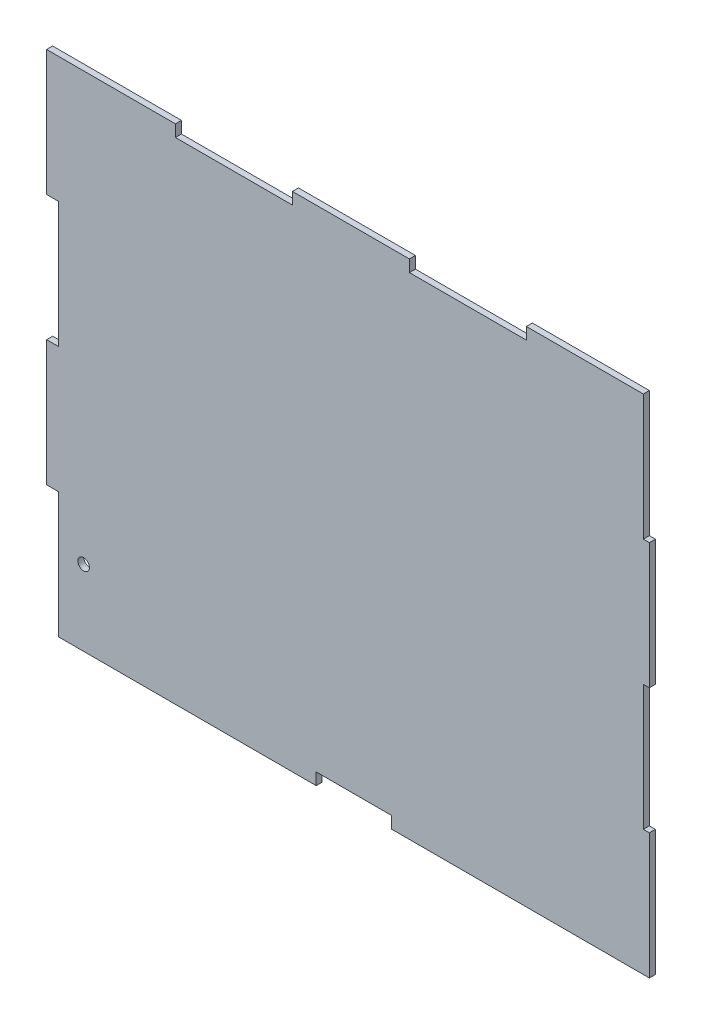
ISO-10303-21;
HEADER;
FILE_DESCRIPTION(('STEP AP214'),'2;1');
FILE_NAME('part.step','',(''),(''),'','','');
FILE_SCHEMA(('AUTOMOTIVE_DESIGN { 1 0 10303 214 1 1 1 1 }'));
ENDSEC;
DATA;
#1=APPLICATION_CONTEXT('core data for automotive mechanical design processes');
#2=APPLICATION_PROTOCOL_DEFINITION('international standard','automotive_design',2000,#1);
#3=PRODUCT_CONTEXT('',#1,'mechanical');
#4=PRODUCT('Part','Part','',(#3));
#5=PRODUCT_RELATED_PRODUCT_CATEGORY('part','',(#4));
#6=PRODUCT_DEFINITION_FORMATION('','',#4);
#7=PRODUCT_DEFINITION_CONTEXT('part definition',#1,'design');
#8=PRODUCT_DEFINITION('design','',#6,#7);
#9=PRODUCT_DEFINITION_SHAPE('','',#8);
#10=(LENGTH_UNIT() NAMED_UNIT(*) SI_UNIT(.MILLI.,.METRE.));
#11=(NAMED_UNIT(*) PLANE_ANGLE_UNIT() SI_UNIT($,.RADIAN.));
#12=(NAMED_UNIT(*) SI_UNIT($,.STERADIAN.) SOLID_ANGLE_UNIT());
#13=UNCERTAINTY_MEASURE_WITH_UNIT(LENGTH_MEASURE(1.E-05),#10,'distance_accuracy_value','');
#14=(GEOMETRIC_REPRESENTATION_CONTEXT(3) GLOBAL_UNCERTAINTY_ASSIGNED_CONTEXT((#13)) GLOBAL_UNIT_ASSIGNED_CONTEXT((#10,
#11,#12)) REPRESENTATION_CONTEXT('',''));
#15=CARTESIAN_POINT('',(0.,0.,0.));
#16=DIRECTION('',(0.,0.,1.));
#17=DIRECTION('',(1.,0.,0.));
#18=AXIS2_PLACEMENT_3D('',#15,#16,#17);
#19=CARTESIAN_POINT('',(59.0804,253.929256228265,3.048));
#20=DIRECTION('',(-1.,0.,0.));
#21=DIRECTION('',(0.,-1.,0.));
#22=AXIS2_PLACEMENT_3D('',#19,#20,#21);
#23=PLANE('',#22);
#24=DIRECTION('',(0.,1.,0.));
#25=VECTOR('',#24,1.);
#26=CARTESIAN_POINT('',(59.0804,253.929256228265,0.));
#27=LINE('',#26,#25);
#28=CARTESIAN_POINT('',(59.0804,247.960256228265,0.));
#29=VERTEX_POINT('',#28);
#30=CARTESIAN_POINT('',(59.0804,253.929256228265,0.));
#31=VERTEX_POINT('',#30);
#32=EDGE_CURVE('E248',#29,#31,#27,.T.);
#33=ORIENTED_EDGE('',*,*,#32,.T.);
#34=DIRECTION('',(0.,0.,-1.));
#35=VECTOR('',#34,1.);
#36=CARTESIAN_POINT('',(59.0804,253.929256228265,3.048));
#37=LINE('',#36,#35);
#38=CARTESIAN_POINT('',(59.0804,253.929256228265,3.048));
#39=VERTEX_POINT('',#38);
#40=EDGE_CURVE('E11',#39,#31,#37,.T.);
#41=ORIENTED_EDGE('',*,*,#40,.F.);
#42=DIRECTION('',(0.,1.,0.));
#43=VECTOR('',#42,1.);
#44=CARTESIAN_POINT('',(59.0804,253.929256228265,3.048));
#45=LINE('',#44,#43);
#46=CARTESIAN_POINT('',(59.0804,247.960256228265,3.048));
#47=VERTEX_POINT('',#46);
#48=EDGE_CURVE('E303',#47,#39,#45,.T.);
#49=ORIENTED_EDGE('',*,*,#48,.F.);
#50=DIRECTION('',(0.,0.,-1.));
#51=VECTOR('',#50,1.);
#52=CARTESIAN_POINT('',(59.0804,247.960256228265,3.048));
#53=LINE('',#52,#51);
#54=EDGE_CURVE('E244',#47,#29,#53,.T.);
#55=ORIENTED_EDGE('',*,*,#54,.T.);
#56=EDGE_LOOP('',(#33,#41,#49,#55));
#57=FACE_BOUND('',#56,.T.);
#58=ADVANCED_FACE('F32',(#57),#23,.F.);
#59=CARTESIAN_POINT('',(-5.9944,253.929256228265,3.048));
#60=DIRECTION('',(0.,-1.,0.));
#61=DIRECTION('',(0.,0.,-1.));
#62=AXIS2_PLACEMENT_3D('',#59,#60,#61);
#63=PLANE('',#62);
#64=DIRECTION('',(-1.,0.,0.));
#65=VECTOR('',#64,1.);
#66=CARTESIAN_POINT('',(-5.9944,253.929256228265,0.));
#67=LINE('',#66,#65);
#68=CARTESIAN_POINT('',(-5.9944,253.929256228265,0.));
#69=VERTEX_POINT('',#68);
#70=EDGE_CURVE('E251',#31,#69,#67,.T.);
#71=ORIENTED_EDGE('',*,*,#70,.T.);
#72=DIRECTION('',(0.,0.,-1.));
#73=VECTOR('',#72,1.);
#74=CARTESIAN_POINT('',(-5.9944,253.929256228265,3.048));
#75=LINE('',#74,#73);
#76=CARTESIAN_POINT('',(-5.9944,253.929256228265,3.048));
#77=VERTEX_POINT('',#76);
#78=EDGE_CURVE('E40',#77,#69,#75,.T.);
#79=ORIENTED_EDGE('',*,*,#78,.F.);
#80=DIRECTION('',(-1.,0.,0.));
#81=VECTOR('',#80,1.);
#82=CARTESIAN_POINT('',(-5.9944,253.929256228265,3.048));
#83=LINE('',#82,#81);
#84=EDGE_CURVE('E151',#39,#77,#83,.T.);
#85=ORIENTED_EDGE('',*,*,#84,.F.);
#86=ORIENTED_EDGE('',*,*,#40,.T.);
#87=EDGE_LOOP('',(#71,#79,#85,#86));
#88=FACE_BOUND('',#87,.T.);
#89=ADVANCED_FACE('F462',(#88),#63,.F.);
#90=CARTESIAN_POINT('',(-5.9944,190.5,3.048));
#91=DIRECTION('',(1.,0.,0.));
#92=DIRECTION('',(0.,1.,0.));
#93=AXIS2_PLACEMENT_3D('',#90,#91,#92);
#94=PLANE('',#93);
#95=DIRECTION('',(0.,-1.,0.));
#96=VECTOR('',#95,1.);
#97=CARTESIAN_POINT('',(-5.9944,190.5,0.));
#98=LINE('',#97,#96);
#99=CARTESIAN_POINT('',(-5.9944,190.5,0.));
#100=VERTEX_POINT('',#99);
#101=EDGE_CURVE('E254',#69,#100,#98,.T.);
#102=ORIENTED_EDGE('',*,*,#101,.T.);
#103=DIRECTION('',(0.,0.,-1.));
#104=VECTOR('',#103,1.);
#105=CARTESIAN_POINT('',(-5.9944,190.5,3.048));
#106=LINE('',#105,#104);
#107=CARTESIAN_POINT('',(-5.9944,190.5,3.048));
#108=VERTEX_POINT('',#107);
#109=EDGE_CURVE('E370',#108,#100,#106,.T.);
#110=ORIENTED_EDGE('',*,*,#109,.F.);
#111=DIRECTION('',(0.,-1.,0.));
#112=VECTOR('',#111,1.);
#113=CARTESIAN_POINT('',(-5.9944,190.5,3.048));
#114=LINE('',#113,#112);
#115=EDGE_CURVE('E378',#77,#108,#114,.T.);
#116=ORIENTED_EDGE('',*,*,#115,.F.);
#117=ORIENTED_EDGE('',*,*,#78,.T.);
#118=EDGE_LOOP('',(#102,#110,#116,#117));
#119=FACE_BOUND('',#118,.T.);
#120=ADVANCED_FACE('F376',(#119),#94,.F.);
#121=CARTESIAN_POINT('',(0.,190.5,3.048));
#122=DIRECTION('',(0.,1.,0.));
#123=DIRECTION('',(0.,0.,1.));
#124=AXIS2_PLACEMENT_3D('',#121,#122,#123);
#125=PLANE('',#124);
#126=DIRECTION('',(1.,0.,0.));
#127=VECTOR('',#126,1.);
#128=CARTESIAN_POINT('',(0.,190.5,0.));
#129=LINE('',#128,#127);
#130=CARTESIAN_POINT('',(0.,190.5,0.));
#131=VERTEX_POINT('',#130);
#132=EDGE_CURVE('E256',#100,#131,#129,.T.);
#133=ORIENTED_EDGE('',*,*,#132,.T.);
#134=DIRECTION('',(0.,0.,-1.));
#135=VECTOR('',#134,1.);
#136=CARTESIAN_POINT('',(0.,190.5,3.048));
#137=LINE('',#136,#135);
#138=CARTESIAN_POINT('',(0.,190.5,3.048));
#139=VERTEX_POINT('',#138);
#140=EDGE_CURVE('E367',#139,#131,#137,.T.);
#141=ORIENTED_EDGE('',*,*,#140,.F.);
#142=DIRECTION('',(1.,0.,0.));
#143=VECTOR('',#142,1.);
#144=CARTESIAN_POINT('',(0.,190.5,3.048));
#145=LINE('',#144,#143);
#146=EDGE_CURVE('E396',#108,#139,#145,.T.);
#147=ORIENTED_EDGE('',*,*,#146,.F.);
#148=ORIENTED_EDGE('',*,*,#109,.T.);
#149=EDGE_LOOP('',(#133,#141,#147,#148));
#150=FACE_BOUND('',#149,.T.);
#151=ADVANCED_FACE('F387',(#150),#125,.F.);
#152=CARTESIAN_POINT('',(0.,127.,3.048));
#153=DIRECTION('',(1.,0.,0.));
#154=DIRECTION('',(0.,0.,-1.));
#155=AXIS2_PLACEMENT_3D('',#152,#153,#154);
#156=PLANE('',#155);
#157=DIRECTION('',(0.,-1.,0.));
#158=VECTOR('',#157,1.);
#159=CARTESIAN_POINT('',(0.,127.,0.));
#160=LINE('',#159,#158);
#161=CARTESIAN_POINT('',(0.,127.,0.));
#162=VERTEX_POINT('',#161);
#163=EDGE_CURVE('E258',#131,#162,#160,.T.);
#164=ORIENTED_EDGE('',*,*,#163,.T.);
#165=DIRECTION('',(0.,0.,-1.));
#166=VECTOR('',#165,1.);
#167=CARTESIAN_POINT('',(0.,127.,3.048));
#168=LINE('',#167,#166);
#169=CARTESIAN_POINT('',(0.,127.,3.048));
#170=VERTEX_POINT('',#169);
#171=EDGE_CURVE('E364',#170,#162,#168,.T.);
#172=ORIENTED_EDGE('',*,*,#171,.F.);
#173=DIRECTION('',(0.,-1.,0.));
#174=VECTOR('',#173,1.);
#175=CARTESIAN_POINT('',(0.,127.,3.048));
#176=LINE('',#175,#174);
#177=EDGE_CURVE('E393',#139,#170,#176,.T.);
#178=ORIENTED_EDGE('',*,*,#177,.F.);
#179=ORIENTED_EDGE('',*,*,#140,.T.);
#180=EDGE_LOOP('',(#164,#172,#178,#179));
#181=FACE_BOUND('',#180,.T.);
#182=ADVANCED_FACE('F391',(#181),#156,.F.);
#183=CARTESIAN_POINT('',(0.,127.,3.048));
#184=DIRECTION('',(0.,-1.,0.));
#185=DIRECTION('',(0.,0.,-1.));
#186=AXIS2_PLACEMENT_3D('',#183,#184,#185);
#187=PLANE('',#186);
#188=DIRECTION('',(-1.,0.,0.));
#189=VECTOR('',#188,1.);
#190=CARTESIAN_POINT('',(0.,127.,0.));
#191=LINE('',#190,#189);
#192=CARTESIAN_POINT('',(-5.9944,127.,0.));
#193=VERTEX_POINT('',#192);
#194=EDGE_CURVE('E260',#162,#193,#191,.T.);
#195=ORIENTED_EDGE('',*,*,#194,.T.);
#196=DIRECTION('',(0.,0.,-1.));
#197=VECTOR('',#196,1.);
#198=CARTESIAN_POINT('',(-5.9944,127.,3.048));
#199=LINE('',#198,#197);
#200=CARTESIAN_POINT('',(-5.9944,127.,3.048));
#201=VERTEX_POINT('',#200);
#202=EDGE_CURVE('E361',#201,#193,#199,.T.);
#203=ORIENTED_EDGE('',*,*,#202,.F.);
#204=DIRECTION('',(-1.,0.,0.));
#205=VECTOR('',#204,1.);
#206=CARTESIAN_POINT('',(0.,127.,3.048));
#207=LINE('',#206,#205);
#208=EDGE_CURVE('E395',#170,#201,#207,.T.);
#209=ORIENTED_EDGE('',*,*,#208,.F.);
#210=ORIENTED_EDGE('',*,*,#171,.T.);
#211=EDGE_LOOP('',(#195,#203,#209,#210));
#212=FACE_BOUND('',#211,.T.);
#213=ADVANCED_FACE('F475',(#212),#187,.F.);
#214=CARTESIAN_POINT('',(-5.9944,63.5,3.048));
#215=DIRECTION('',(1.,0.,0.));
#216=DIRECTION('',(0.,0.,-1.));
#217=AXIS2_PLACEMENT_3D('',#214,#215,#216);
#218=PLANE('',#217);
#219=DIRECTION('',(0.,-1.,0.));
#220=VECTOR('',#219,1.);
#221=CARTESIAN_POINT('',(-5.9944,63.5,0.));
#222=LINE('',#221,#220);
#223=CARTESIAN_POINT('',(-5.9944,63.5,0.));
#224=VERTEX_POINT('',#223);
#225=EDGE_CURVE('E262',#193,#224,#222,.T.);
#226=ORIENTED_EDGE('',*,*,#225,.T.);
#227=DIRECTION('',(0.,0.,-1.));
#228=VECTOR('',#227,1.);
#229=CARTESIAN_POINT('',(-5.9944,63.5,3.048));
#230=LINE('',#229,#228);
#231=CARTESIAN_POINT('',(-5.9944,63.5,3.048));
#232=VERTEX_POINT('',#231);
#233=EDGE_CURVE('E358',#232,#224,#230,.T.);
#234=ORIENTED_EDGE('',*,*,#233,.F.);
#235=DIRECTION('',(0.,-1.,0.));
#236=VECTOR('',#235,1.);
#237=CARTESIAN_POINT('',(-5.9944,63.5,3.048));
#238=LINE('',#237,#236);
#239=EDGE_CURVE('E398',#201,#232,#238,.T.);
#240=ORIENTED_EDGE('',*,*,#239,.F.);
#241=ORIENTED_EDGE('',*,*,#202,.T.);
#242=EDGE_LOOP('',(#226,#234,#240,#241));
#243=FACE_BOUND('',#242,.T.);
#244=ADVANCED_FACE('F478',(#243),#218,.F.);
#245=CARTESIAN_POINT('',(0.,63.5,3.048));
#246=DIRECTION('',(0.,1.,0.));
#247=DIRECTION('',(0.,0.,1.));
#248=AXIS2_PLACEMENT_3D('',#245,#246,#247);
#249=PLANE('',#248);
#250=DIRECTION('',(1.,0.,0.));
#251=VECTOR('',#250,1.);
#252=CARTESIAN_POINT('',(0.,63.5,0.));
#253=LINE('',#252,#251);
#254=CARTESIAN_POINT('',(0.,63.5,0.));
#255=VERTEX_POINT('',#254);
#256=EDGE_CURVE('E264',#224,#255,#253,.T.);
#257=ORIENTED_EDGE('',*,*,#256,.T.);
#258=DIRECTION('',(0.,0.,-1.));
#259=VECTOR('',#258,1.);
#260=CARTESIAN_POINT('',(0.,63.5,3.048));
#261=LINE('',#260,#259);
#262=CARTESIAN_POINT('',(0.,63.5,3.048));
#263=VERTEX_POINT('',#262);
#264=EDGE_CURVE('E355',#263,#255,#261,.T.);
#265=ORIENTED_EDGE('',*,*,#264,.F.);
#266=DIRECTION('',(1.,0.,0.));
#267=VECTOR('',#266,1.);
#268=CARTESIAN_POINT('',(0.,63.5,3.048));
#269=LINE('',#268,#267);
#270=EDGE_CURVE('E404',#232,#263,#269,.T.);
#271=ORIENTED_EDGE('',*,*,#270,.F.);
#272=ORIENTED_EDGE('',*,*,#233,.T.);
#273=EDGE_LOOP('',(#257,#265,#271,#272));
#274=FACE_BOUND('',#273,.T.);
#275=ADVANCED_FACE('F482',(#274),#249,.F.);
#276=CARTESIAN_POINT('',(0.,0.,3.048));
#277=DIRECTION('',(1.,0.,0.));
#278=DIRECTION('',(0.,0.,-1.));
#279=AXIS2_PLACEMENT_3D('',#276,#277,#278);
#280=PLANE('',#279);
#281=DIRECTION('',(0.,-1.,0.));
#282=VECTOR('',#281,1.);
#283=CARTESIAN_POINT('',(0.,0.,0.));
#284=LINE('',#283,#282);
#285=CARTESIAN_POINT('',(0.,0.,0.));
#286=VERTEX_POINT('',#285);
#287=EDGE_CURVE('E266',#255,#286,#284,.T.);
#288=ORIENTED_EDGE('',*,*,#287,.T.);
#289=DIRECTION('',(0.,0.,-1.));
#290=VECTOR('',#289,1.);
#291=CARTESIAN_POINT('',(0.,0.,3.048));
#292=LINE('',#291,#290);
#293=CARTESIAN_POINT('',(0.,0.,3.048));
#294=VERTEX_POINT('',#293);
#295=EDGE_CURVE('E352',#294,#286,#292,.T.);
#296=ORIENTED_EDGE('',*,*,#295,.F.);
#297=DIRECTION('',(0.,-1.,0.));
#298=VECTOR('',#297,1.);
#299=CARTESIAN_POINT('',(0.,0.,3.048));
#300=LINE('',#299,#298);
#301=EDGE_CURVE('E406',#263,#294,#300,.T.);
#302=ORIENTED_EDGE('',*,*,#301,.F.);
#303=ORIENTED_EDGE('',*,*,#264,.T.);
#304=EDGE_LOOP('',(#288,#296,#302,#303));
#305=FACE_BOUND('',#304,.T.);
#306=ADVANCED_FACE('F486',(#305),#280,.F.);
#307=CARTESIAN_POINT('',(0.,0.,3.048));
#308=DIRECTION('',(0.,1.,0.));
#309=DIRECTION('',(0.,0.,1.));
#310=AXIS2_PLACEMENT_3D('',#307,#308,#309);
#311=PLANE('',#310);
#312=DIRECTION('',(1.,0.,0.));
#313=VECTOR('',#312,1.);
#314=CARTESIAN_POINT('',(0.,0.,0.));
#315=LINE('',#314,#313);
#316=CARTESIAN_POINT('',(130.175,0.,0.));
#317=VERTEX_POINT('',#316);
#318=EDGE_CURVE('E268',#286,#317,#315,.T.);
#319=ORIENTED_EDGE('',*,*,#318,.T.);
#320=DIRECTION('',(0.,0.,-1.));
#321=VECTOR('',#320,1.);
#322=CARTESIAN_POINT('',(130.175,0.,3.048));
#323=LINE('',#322,#321);
#324=CARTESIAN_POINT('',(130.175,0.,3.048));
#325=VERTEX_POINT('',#324);
#326=EDGE_CURVE('E349',#325,#317,#323,.T.);
#327=ORIENTED_EDGE('',*,*,#326,.F.);
#328=DIRECTION('',(1.,0.,0.));
#329=VECTOR('',#328,1.);
#330=CARTESIAN_POINT('',(0.,0.,3.048));
#331=LINE('',#330,#329);
#332=EDGE_CURVE('E408',#294,#325,#331,.T.);
#333=ORIENTED_EDGE('',*,*,#332,.F.);
#334=ORIENTED_EDGE('',*,*,#295,.T.);
#335=EDGE_LOOP('',(#319,#327,#333,#334));
#336=FACE_BOUND('',#335,.T.);
#337=ADVANCED_FACE('F490',(#336),#311,.F.);
#338=CARTESIAN_POINT('',(130.175,0.,3.048));
#339=DIRECTION('',(-1.,0.,0.));
#340=DIRECTION('',(0.,0.,1.));
#341=AXIS2_PLACEMENT_3D('',#338,#339,#340);
#342=PLANE('',#341);
#343=DIRECTION('',(0.,1.,0.));
#344=VECTOR('',#343,1.);
#345=CARTESIAN_POINT('',(130.175,0.,0.));
#346=LINE('',#345,#344);
#347=CARTESIAN_POINT('',(130.175,5.99439999999999,0.));
#348=VERTEX_POINT('',#347);
#349=EDGE_CURVE('E270',#317,#348,#346,.T.);
#350=ORIENTED_EDGE('',*,*,#349,.T.);
#351=DIRECTION('',(0.,0.,-1.));
#352=VECTOR('',#351,1.);
#353=CARTESIAN_POINT('',(130.175,5.99439999999999,3.048));
#354=LINE('',#353,#352);
#355=CARTESIAN_POINT('',(130.175,5.99439999999999,3.048));
#356=VERTEX_POINT('',#355);
#357=EDGE_CURVE('E346',#356,#348,#354,.T.);
#358=ORIENTED_EDGE('',*,*,#357,.F.);
#359=DIRECTION('',(0.,1.,0.));
#360=VECTOR('',#359,1.);
#361=CARTESIAN_POINT('',(130.175,0.,3.048));
#362=LINE('',#361,#360);
#363=EDGE_CURVE('E410',#325,#356,#362,.T.);
#364=ORIENTED_EDGE('',*,*,#363,.F.);
#365=ORIENTED_EDGE('',*,*,#326,.T.);
#366=EDGE_LOOP('',(#350,#358,#364,#365));
#367=FACE_BOUND('',#366,.T.);
#368=ADVANCED_FACE('F494',(#367),#342,.F.);
#369=CARTESIAN_POINT('',(130.175,5.99439999999999,3.048));
#370=DIRECTION('',(0.,1.,0.));
#371=DIRECTION('',(0.,0.,1.));
#372=AXIS2_PLACEMENT_3D('',#369,#370,#371);
#373=PLANE('',#372);
#374=DIRECTION('',(1.,0.,0.));
#375=VECTOR('',#374,1.);
#376=CARTESIAN_POINT('',(130.175,5.99439999999999,0.));
#377=LINE('',#376,#375);
#378=CARTESIAN_POINT('',(168.275,5.99439999999999,0.));
#379=VERTEX_POINT('',#378);
#380=EDGE_CURVE('E272',#348,#379,#377,.T.);
#381=ORIENTED_EDGE('',*,*,#380,.T.);
#382=DIRECTION('',(0.,0.,-1.));
#383=VECTOR('',#382,1.);
#384=CARTESIAN_POINT('',(168.275,5.99439999999999,3.048));
#385=LINE('',#384,#383);
#386=CARTESIAN_POINT('',(168.275,5.99439999999999,3.048));
#387=VERTEX_POINT('',#386);
#388=EDGE_CURVE('E343',#387,#379,#385,.T.);
#389=ORIENTED_EDGE('',*,*,#388,.F.);
#390=DIRECTION('',(1.,0.,0.));
#391=VECTOR('',#390,1.);
#392=CARTESIAN_POINT('',(130.175,5.99439999999999,3.048));
#393=LINE('',#392,#391);
#394=EDGE_CURVE('E412',#356,#387,#393,.T.);
#395=ORIENTED_EDGE('',*,*,#394,.F.);
#396=ORIENTED_EDGE('',*,*,#357,.T.);
#397=EDGE_LOOP('',(#381,#389,#395,#396));
#398=FACE_BOUND('',#397,.T.);
#399=ADVANCED_FACE('F498',(#398),#373,.F.);
#400=CARTESIAN_POINT('',(168.275,5.99439999999999,3.048));
#401=DIRECTION('',(1.,0.,0.));
#402=DIRECTION('',(0.,0.,-1.));
#403=AXIS2_PLACEMENT_3D('',#400,#401,#402);
#404=PLANE('',#403);
#405=DIRECTION('',(0.,-1.,0.));
#406=VECTOR('',#405,1.);
#407=CARTESIAN_POINT('',(168.275,5.99439999999999,0.));
#408=LINE('',#407,#406);
#409=CARTESIAN_POINT('',(168.275,0.,0.));
#410=VERTEX_POINT('',#409);
#411=EDGE_CURVE('E274',#379,#410,#408,.T.);
#412=ORIENTED_EDGE('',*,*,#411,.T.);
#413=DIRECTION('',(0.,0.,-1.));
#414=VECTOR('',#413,1.);
#415=CARTESIAN_POINT('',(168.275,0.,3.048));
#416=LINE('',#415,#414);
#417=CARTESIAN_POINT('',(168.275,0.,3.048));
#418=VERTEX_POINT('',#417);
#419=EDGE_CURVE('E340',#418,#410,#416,.T.);
#420=ORIENTED_EDGE('',*,*,#419,.F.);
#421=DIRECTION('',(0.,-1.,0.));
#422=VECTOR('',#421,1.);
#423=CARTESIAN_POINT('',(168.275,5.99439999999999,3.048));
#424=LINE('',#423,#422);
#425=EDGE_CURVE('E414',#387,#418,#424,.T.);
#426=ORIENTED_EDGE('',*,*,#425,.F.);
#427=ORIENTED_EDGE('',*,*,#388,.T.);
#428=EDGE_LOOP('',(#412,#420,#426,#427));
#429=FACE_BOUND('',#428,.T.);
#430=ADVANCED_FACE('F502',(#429),#404,.F.);
#431=CARTESIAN_POINT('',(168.275,0.,3.048));
#432=DIRECTION('',(0.,1.,0.));
#433=DIRECTION('',(0.,0.,1.));
#434=AXIS2_PLACEMENT_3D('',#431,#432,#433);
#435=PLANE('',#434);
#436=DIRECTION('',(1.,0.,0.));
#437=VECTOR('',#436,1.);
#438=CARTESIAN_POINT('',(168.275,0.,0.));
#439=LINE('',#438,#437);
#440=CARTESIAN_POINT('',(298.45,0.,0.));
#441=VERTEX_POINT('',#440);
#442=EDGE_CURVE('E276',#410,#441,#439,.T.);
#443=ORIENTED_EDGE('',*,*,#442,.T.);
#444=DIRECTION('',(0.,0.,-1.));
#445=VECTOR('',#444,1.);
#446=CARTESIAN_POINT('',(298.45,0.,3.048));
#447=LINE('',#446,#445);
#448=CARTESIAN_POINT('',(298.45,0.,3.048));
#449=VERTEX_POINT('',#448);
#450=EDGE_CURVE('E337',#449,#441,#447,.T.);
#451=ORIENTED_EDGE('',*,*,#450,.F.);
#452=DIRECTION('',(1.,0.,0.));
#453=VECTOR('',#452,1.);
#454=CARTESIAN_POINT('',(168.275,0.,3.048));
#455=LINE('',#454,#453);
#456=EDGE_CURVE('E416',#418,#449,#455,.T.);
#457=ORIENTED_EDGE('',*,*,#456,.F.);
#458=ORIENTED_EDGE('',*,*,#419,.T.);
#459=EDGE_LOOP('',(#443,#451,#457,#458));
#460=FACE_BOUND('',#459,.T.);
#461=ADVANCED_FACE('F506',(#460),#435,.F.);
#462=CARTESIAN_POINT('',(298.45,0.,3.048));
#463=DIRECTION('',(-1.,0.,0.));
#464=DIRECTION('',(0.,0.,1.));
#465=AXIS2_PLACEMENT_3D('',#462,#463,#464);
#466=PLANE('',#465);
#467=DIRECTION('',(0.,1.,0.));
#468=VECTOR('',#467,1.);
#469=CARTESIAN_POINT('',(298.45,0.,0.));
#470=LINE('',#469,#468);
#471=CARTESIAN_POINT('',(298.45,63.5,0.));
#472=VERTEX_POINT('',#471);
#473=EDGE_CURVE('E278',#441,#472,#470,.T.);
#474=ORIENTED_EDGE('',*,*,#473,.T.);
#475=DIRECTION('',(0.,0.,-1.));
#476=VECTOR('',#475,1.);
#477=CARTESIAN_POINT('',(298.45,63.5,3.048));
#478=LINE('',#477,#476);
#479=CARTESIAN_POINT('',(298.45,63.5,3.048));
#480=VERTEX_POINT('',#479);
#481=EDGE_CURVE('E334',#480,#472,#478,.T.);
#482=ORIENTED_EDGE('',*,*,#481,.F.);
#483=DIRECTION('',(0.,1.,0.));
#484=VECTOR('',#483,1.);
#485=CARTESIAN_POINT('',(298.45,0.,3.048));
#486=LINE('',#485,#484);
#487=EDGE_CURVE('E418',#449,#480,#486,.T.);
#488=ORIENTED_EDGE('',*,*,#487,.F.);
#489=ORIENTED_EDGE('',*,*,#450,.T.);
#490=EDGE_LOOP('',(#474,#482,#488,#489));
#491=FACE_BOUND('',#490,.T.);
#492=ADVANCED_FACE('F510',(#491),#466,.F.);
#493=CARTESIAN_POINT('',(298.45,63.5,3.048));
#494=DIRECTION('',(0.,-1.,0.));
#495=DIRECTION('',(0.,0.,-1.));
#496=AXIS2_PLACEMENT_3D('',#493,#494,#495);
#497=PLANE('',#496);
#498=DIRECTION('',(-1.,0.,0.));
#499=VECTOR('',#498,1.);
#500=CARTESIAN_POINT('',(298.45,63.5,0.));
#501=LINE('',#500,#499);
#502=CARTESIAN_POINT('',(295.402,63.5,0.));
#503=VERTEX_POINT('',#502);
#504=EDGE_CURVE('E280',#472,#503,#501,.T.);
#505=ORIENTED_EDGE('',*,*,#504,.T.);
#506=DIRECTION('',(0.,0.,-1.));
#507=VECTOR('',#506,1.);
#508=CARTESIAN_POINT('',(295.402,63.5,3.048));
#509=LINE('',#508,#507);
#510=CARTESIAN_POINT('',(295.402,63.5,3.048));
#511=VERTEX_POINT('',#510);
#512=EDGE_CURVE('E331',#511,#503,#509,.T.);
#513=ORIENTED_EDGE('',*,*,#512,.F.);
#514=DIRECTION('',(-1.,0.,0.));
#515=VECTOR('',#514,1.);
#516=CARTESIAN_POINT('',(298.45,63.5,3.048));
#517=LINE('',#516,#515);
#518=EDGE_CURVE('E420',#480,#511,#517,.T.);
#519=ORIENTED_EDGE('',*,*,#518,.F.);
#520=ORIENTED_EDGE('',*,*,#481,.T.);
#521=EDGE_LOOP('',(#505,#513,#519,#520));
#522=FACE_BOUND('',#521,.T.);
#523=ADVANCED_FACE('F514',(#522),#497,.F.);
#524=CARTESIAN_POINT('',(295.402,63.5,3.048));
#525=DIRECTION('',(-1.,0.,0.));
#526=DIRECTION('',(0.,-1.,0.));
#527=AXIS2_PLACEMENT_3D('',#524,#525,#526);
#528=PLANE('',#527);
#529=DIRECTION('',(0.,1.,0.));
#530=VECTOR('',#529,1.);
#531=CARTESIAN_POINT('',(295.402,63.5,0.));
#532=LINE('',#531,#530);
#533=CARTESIAN_POINT('',(295.402,126.929256228265,0.));
#534=VERTEX_POINT('',#533);
#535=EDGE_CURVE('E282',#503,#534,#532,.T.);
#536=ORIENTED_EDGE('',*,*,#535,.T.);
#537=DIRECTION('',(0.,0.,-1.));
#538=VECTOR('',#537,1.);
#539=CARTESIAN_POINT('',(295.402,126.929256228265,3.048));
#540=LINE('',#539,#538);
#541=CARTESIAN_POINT('',(295.402,126.929256228265,3.048));
#542=VERTEX_POINT('',#541);
#543=EDGE_CURVE('E328',#542,#534,#540,.T.);
#544=ORIENTED_EDGE('',*,*,#543,.F.);
#545=DIRECTION('',(0.,1.,0.));
#546=VECTOR('',#545,1.);
#547=CARTESIAN_POINT('',(295.402,63.5,3.048));
#548=LINE('',#547,#546);
#549=EDGE_CURVE('E422',#511,#542,#548,.T.);
#550=ORIENTED_EDGE('',*,*,#549,.F.);
#551=ORIENTED_EDGE('',*,*,#512,.T.);
#552=EDGE_LOOP('',(#536,#544,#550,#551));
#553=FACE_BOUND('',#552,.T.);
#554=ADVANCED_FACE('F518',(#553),#528,.F.);
#555=CARTESIAN_POINT('',(295.402,126.929256228265,3.048));
#556=DIRECTION('',(0.,1.,0.));
#557=DIRECTION('',(0.,0.,1.));
#558=AXIS2_PLACEMENT_3D('',#555,#556,#557);
#559=PLANE('',#558);
#560=DIRECTION('',(1.,0.,0.));
#561=VECTOR('',#560,1.);
#562=CARTESIAN_POINT('',(295.402,126.929256228265,0.));
#563=LINE('',#562,#561);
#564=CARTESIAN_POINT('',(298.45,126.929256228265,0.));
#565=VERTEX_POINT('',#564);
#566=EDGE_CURVE('E284',#534,#565,#563,.T.);
#567=ORIENTED_EDGE('',*,*,#566,.T.);
#568=DIRECTION('',(0.,0.,-1.));
#569=VECTOR('',#568,1.);
#570=CARTESIAN_POINT('',(298.45,126.929256228265,3.048));
#571=LINE('',#570,#569);
#572=CARTESIAN_POINT('',(298.45,126.929256228265,3.048));
#573=VERTEX_POINT('',#572);
#574=EDGE_CURVE('E325',#573,#565,#571,.T.);
#575=ORIENTED_EDGE('',*,*,#574,.F.);
#576=DIRECTION('',(1.,0.,0.));
#577=VECTOR('',#576,1.);
#578=CARTESIAN_POINT('',(295.402,126.929256228265,3.048));
#579=LINE('',#578,#577);
#580=EDGE_CURVE('E424',#542,#573,#579,.T.);
#581=ORIENTED_EDGE('',*,*,#580,.F.);
#582=ORIENTED_EDGE('',*,*,#543,.T.);
#583=EDGE_LOOP('',(#567,#575,#581,#582));
#584=FACE_BOUND('',#583,.T.);
#585=ADVANCED_FACE('F522',(#584),#559,.F.);
#586=CARTESIAN_POINT('',(298.45,126.929256228265,3.048));
#587=DIRECTION('',(-1.,0.,0.));
#588=DIRECTION('',(0.,0.,1.));
#589=AXIS2_PLACEMENT_3D('',#586,#587,#588);
#590=PLANE('',#589);
#591=DIRECTION('',(0.,1.,0.));
#592=VECTOR('',#591,1.);
#593=CARTESIAN_POINT('',(298.45,126.929256228265,0.));
#594=LINE('',#593,#592);
#595=CARTESIAN_POINT('',(298.45,190.429256228265,0.));
#596=VERTEX_POINT('',#595);
#597=EDGE_CURVE('E286',#565,#596,#594,.T.);
#598=ORIENTED_EDGE('',*,*,#597,.T.);
#599=DIRECTION('',(0.,0.,-1.));
#600=VECTOR('',#599,1.);
#601=CARTESIAN_POINT('',(298.45,190.429256228265,3.048));
#602=LINE('',#601,#600);
#603=CARTESIAN_POINT('',(298.45,190.429256228265,3.048));
#604=VERTEX_POINT('',#603);
#605=EDGE_CURVE('E322',#604,#596,#602,.T.);
#606=ORIENTED_EDGE('',*,*,#605,.F.);
#607=DIRECTION('',(0.,1.,0.));
#608=VECTOR('',#607,1.);
#609=CARTESIAN_POINT('',(298.45,126.929256228265,3.048));
#610=LINE('',#609,#608);
#611=EDGE_CURVE('E426',#573,#604,#610,.T.);
#612=ORIENTED_EDGE('',*,*,#611,.F.);
#613=ORIENTED_EDGE('',*,*,#574,.T.);
#614=EDGE_LOOP('',(#598,#606,#612,#613));
#615=FACE_BOUND('',#614,.T.);
#616=ADVANCED_FACE('F526',(#615),#590,.F.);
#617=CARTESIAN_POINT('',(298.45,190.429256228265,3.048));
#618=DIRECTION('',(0.,-1.,0.));
#619=DIRECTION('',(0.,0.,-1.));
#620=AXIS2_PLACEMENT_3D('',#617,#618,#619);
#621=PLANE('',#620);
#622=DIRECTION('',(-1.,0.,0.));
#623=VECTOR('',#622,1.);
#624=CARTESIAN_POINT('',(298.45,190.429256228265,0.));
#625=LINE('',#624,#623);
#626=CARTESIAN_POINT('',(295.402,190.429256228265,0.));
#627=VERTEX_POINT('',#626);
#628=EDGE_CURVE('E288',#596,#627,#625,.T.);
#629=ORIENTED_EDGE('',*,*,#628,.T.);
#630=DIRECTION('',(0.,0.,-1.));
#631=VECTOR('',#630,1.);
#632=CARTESIAN_POINT('',(295.402,190.429256228265,3.048));
#633=LINE('',#632,#631);
#634=CARTESIAN_POINT('',(295.402,190.429256228265,3.048));
#635=VERTEX_POINT('',#634);
#636=EDGE_CURVE('E319',#635,#627,#633,.T.);
#637=ORIENTED_EDGE('',*,*,#636,.F.);
#638=DIRECTION('',(-1.,0.,0.));
#639=VECTOR('',#638,1.);
#640=CARTESIAN_POINT('',(298.45,190.429256228265,3.048));
#641=LINE('',#640,#639);
#642=EDGE_CURVE('E428',#604,#635,#641,.T.);
#643=ORIENTED_EDGE('',*,*,#642,.F.);
#644=ORIENTED_EDGE('',*,*,#605,.T.);
#645=EDGE_LOOP('',(#629,#637,#643,#644));
#646=FACE_BOUND('',#645,.T.);
#647=ADVANCED_FACE('F530',(#646),#621,.F.);
#648=CARTESIAN_POINT('',(295.402,190.429256228265,3.048));
#649=DIRECTION('',(-1.,0.,0.));
#650=DIRECTION('',(0.,0.,1.));
#651=AXIS2_PLACEMENT_3D('',#648,#649,#650);
#652=PLANE('',#651);
#653=DIRECTION('',(0.,1.,0.));
#654=VECTOR('',#653,1.);
#655=CARTESIAN_POINT('',(295.402,190.429256228265,0.));
#656=LINE('',#655,#654);
#657=CARTESIAN_POINT('',(295.402,253.929256228265,0.));
#658=VERTEX_POINT('',#657);
#659=EDGE_CURVE('E290',#627,#658,#656,.T.);
#660=ORIENTED_EDGE('',*,*,#659,.T.);
#661=DIRECTION('',(0.,0.,-1.));
#662=VECTOR('',#661,1.);
#663=CARTESIAN_POINT('',(295.402,253.929256228265,3.048));
#664=LINE('',#663,#662);
#665=CARTESIAN_POINT('',(295.402,253.929256228265,3.048));
#666=VERTEX_POINT('',#665);
#667=EDGE_CURVE('E316',#666,#658,#664,.T.);
#668=ORIENTED_EDGE('',*,*,#667,.F.);
#669=DIRECTION('',(0.,1.,0.));
#670=VECTOR('',#669,1.);
#671=CARTESIAN_POINT('',(295.402,190.429256228265,3.048));
#672=LINE('',#671,#670);
#673=EDGE_CURVE('E430',#635,#666,#672,.T.);
#674=ORIENTED_EDGE('',*,*,#673,.F.);
#675=ORIENTED_EDGE('',*,*,#636,.T.);
#676=EDGE_LOOP('',(#660,#668,#674,#675));
#677=FACE_BOUND('',#676,.T.);
#678=ADVANCED_FACE('F534',(#677),#652,.F.);
#679=CARTESIAN_POINT('',(236.3216,253.929256228265,3.048));
#680=DIRECTION('',(0.,-1.,0.));
#681=DIRECTION('',(0.,0.,-1.));
#682=AXIS2_PLACEMENT_3D('',#679,#680,#681);
#683=PLANE('',#682);
#684=DIRECTION('',(-1.,0.,0.));
#685=VECTOR('',#684,1.);
#686=CARTESIAN_POINT('',(236.3216,253.929256228265,0.));
#687=LINE('',#686,#685);
#688=CARTESIAN_POINT('',(236.3216,253.929256228265,0.));
#689=VERTEX_POINT('',#688);
#690=EDGE_CURVE('E292',#658,#689,#687,.T.);
#691=ORIENTED_EDGE('',*,*,#690,.T.);
#692=DIRECTION('',(0.,0.,-1.));
#693=VECTOR('',#692,1.);
#694=CARTESIAN_POINT('',(236.3216,253.929256228265,3.048));
#695=LINE('',#694,#693);
#696=CARTESIAN_POINT('',(236.3216,253.929256228265,3.048));
#697=VERTEX_POINT('',#696);
#698=EDGE_CURVE('E313',#697,#689,#695,.T.);
#699=ORIENTED_EDGE('',*,*,#698,.F.);
#700=DIRECTION('',(-1.,0.,0.));
#701=VECTOR('',#700,1.);
#702=CARTESIAN_POINT('',(236.3216,253.929256228265,3.048));
#703=LINE('',#702,#701);
#704=EDGE_CURVE('E432',#666,#697,#703,.T.);
#705=ORIENTED_EDGE('',*,*,#704,.F.);
#706=ORIENTED_EDGE('',*,*,#667,.T.);
#707=EDGE_LOOP('',(#691,#699,#705,#706));
#708=FACE_BOUND('',#707,.T.);
#709=ADVANCED_FACE('F538',(#708),#683,.F.);
#710=CARTESIAN_POINT('',(236.3216,247.960256228265,3.048));
#711=DIRECTION('',(1.,0.,0.));
#712=DIRECTION('',(0.,0.,-1.));
#713=AXIS2_PLACEMENT_3D('',#710,#711,#712);
#714=PLANE('',#713);
#715=DIRECTION('',(0.,-1.,0.));
#716=VECTOR('',#715,1.);
#717=CARTESIAN_POINT('',(236.3216,247.960256228265,0.));
#718=LINE('',#717,#716);
#719=CARTESIAN_POINT('',(236.3216,247.960256228265,0.));
#720=VERTEX_POINT('',#719);
#721=EDGE_CURVE('E294',#689,#720,#718,.T.);
#722=ORIENTED_EDGE('',*,*,#721,.T.);
#723=DIRECTION('',(0.,0.,-1.));
#724=VECTOR('',#723,1.);
#725=CARTESIAN_POINT('',(236.3216,247.960256228265,3.048));
#726=LINE('',#725,#724);
#727=CARTESIAN_POINT('',(236.3216,247.960256228265,3.048));
#728=VERTEX_POINT('',#727);
#729=EDGE_CURVE('E310',#728,#720,#726,.T.);
#730=ORIENTED_EDGE('',*,*,#729,.F.);
#731=DIRECTION('',(0.,-1.,0.));
#732=VECTOR('',#731,1.);
#733=CARTESIAN_POINT('',(236.3216,247.960256228265,3.048));
#734=LINE('',#733,#732);
#735=EDGE_CURVE('E434',#697,#728,#734,.T.);
#736=ORIENTED_EDGE('',*,*,#735,.F.);
#737=ORIENTED_EDGE('',*,*,#698,.T.);
#738=EDGE_LOOP('',(#722,#730,#736,#737));
#739=FACE_BOUND('',#738,.T.);
#740=ADVANCED_FACE('F542',(#739),#714,.F.);
#741=CARTESIAN_POINT('',(177.2412,247.960256228265,3.048));
#742=DIRECTION('',(0.,-1.,0.));
#743=DIRECTION('',(0.,0.,-1.));
#744=AXIS2_PLACEMENT_3D('',#741,#742,#743);
#745=PLANE('',#744);
#746=DIRECTION('',(-1.,0.,0.));
#747=VECTOR('',#746,1.);
#748=CARTESIAN_POINT('',(177.2412,247.960256228265,0.));
#749=LINE('',#748,#747);
#750=CARTESIAN_POINT('',(177.2412,247.960256228265,0.));
#751=VERTEX_POINT('',#750);
#752=EDGE_CURVE('E296',#720,#751,#749,.T.);
#753=ORIENTED_EDGE('',*,*,#752,.T.);
#754=DIRECTION('',(0.,0.,-1.));
#755=VECTOR('',#754,1.);
#756=CARTESIAN_POINT('',(177.2412,247.960256228265,3.048));
#757=LINE('',#756,#755);
#758=CARTESIAN_POINT('',(177.2412,247.960256228265,3.048));
#759=VERTEX_POINT('',#758);
#760=EDGE_CURVE('E307',#759,#751,#757,.T.);
#761=ORIENTED_EDGE('',*,*,#760,.F.);
#762=DIRECTION('',(-1.,0.,0.));
#763=VECTOR('',#762,1.);
#764=CARTESIAN_POINT('',(177.2412,247.960256228265,3.048));
#765=LINE('',#764,#763);
#766=EDGE_CURVE('E436',#728,#759,#765,.T.);
#767=ORIENTED_EDGE('',*,*,#766,.F.);
#768=ORIENTED_EDGE('',*,*,#729,.T.);
#769=EDGE_LOOP('',(#753,#761,#767,#768));
#770=FACE_BOUND('',#769,.T.);
#771=ADVANCED_FACE('F442',(#770),#745,.F.);
#772=CARTESIAN_POINT('',(177.2412,253.929256228265,3.048));
#773=DIRECTION('',(-1.,0.,0.));
#774=DIRECTION('',(0.,0.,1.));
#775=AXIS2_PLACEMENT_3D('',#772,#773,#774);
#776=PLANE('',#775);
#777=DIRECTION('',(0.,1.,0.));
#778=VECTOR('',#777,1.);
#779=CARTESIAN_POINT('',(177.2412,253.929256228265,0.));
#780=LINE('',#779,#778);
#781=CARTESIAN_POINT('',(177.2412,253.929256228265,0.));
#782=VERTEX_POINT('',#781);
#783=EDGE_CURVE('E298',#751,#782,#780,.T.);
#784=ORIENTED_EDGE('',*,*,#783,.T.);
#785=DIRECTION('',(0.,0.,-1.));
#786=VECTOR('',#785,1.);
#787=CARTESIAN_POINT('',(177.2412,253.929256228265,3.048));
#788=LINE('',#787,#786);
#789=CARTESIAN_POINT('',(177.2412,253.929256228265,3.048));
#790=VERTEX_POINT('',#789);
#791=EDGE_CURVE('E239',#790,#782,#788,.T.);
#792=ORIENTED_EDGE('',*,*,#791,.F.);
#793=DIRECTION('',(0.,1.,0.));
#794=VECTOR('',#793,1.);
#795=CARTESIAN_POINT('',(177.2412,253.929256228265,3.048));
#796=LINE('',#795,#794);
#797=EDGE_CURVE('E230',#759,#790,#796,.T.);
#798=ORIENTED_EDGE('',*,*,#797,.F.);
#799=ORIENTED_EDGE('',*,*,#760,.T.);
#800=EDGE_LOOP('',(#784,#792,#798,#799));
#801=FACE_BOUND('',#800,.T.);
#802=ADVANCED_FACE('F446',(#801),#776,.F.);
#803=CARTESIAN_POINT('',(118.1608,253.929256228265,3.048));
#804=DIRECTION('',(0.,-1.,0.));
#805=DIRECTION('',(0.,0.,-1.));
#806=AXIS2_PLACEMENT_3D('',#803,#804,#805);
#807=PLANE('',#806);
#808=DIRECTION('',(-1.,0.,0.));
#809=VECTOR('',#808,1.);
#810=CARTESIAN_POINT('',(118.1608,253.929256228265,0.));
#811=LINE('',#810,#809);
#812=CARTESIAN_POINT('',(118.1608,253.929256228265,0.));
#813=VERTEX_POINT('',#812);
#814=EDGE_CURVE('E238',#782,#813,#811,.T.);
#815=ORIENTED_EDGE('',*,*,#814,.T.);
#816=DIRECTION('',(0.,0.,-1.));
#817=VECTOR('',#816,1.);
#818=CARTESIAN_POINT('',(118.1608,253.929256228265,3.048));
#819=LINE('',#818,#817);
#820=CARTESIAN_POINT('',(118.1608,253.929256228265,3.048));
#821=VERTEX_POINT('',#820);
#822=EDGE_CURVE('E235',#821,#813,#819,.T.);
#823=ORIENTED_EDGE('',*,*,#822,.F.);
#824=DIRECTION('',(-1.,0.,0.));
#825=VECTOR('',#824,1.);
#826=CARTESIAN_POINT('',(118.1608,253.929256228265,3.048));
#827=LINE('',#826,#825);
#828=EDGE_CURVE('E224',#790,#821,#827,.T.);
#829=ORIENTED_EDGE('',*,*,#828,.F.);
#830=ORIENTED_EDGE('',*,*,#791,.T.);
#831=EDGE_LOOP('',(#815,#823,#829,#830));
#832=FACE_BOUND('',#831,.T.);
#833=ADVANCED_FACE('F236',(#832),#807,.F.);
#834=CARTESIAN_POINT('',(118.1608,247.960256228265,3.048));
#835=DIRECTION('',(1.,0.,0.));
#836=DIRECTION('',(0.,0.,-1.));
#837=AXIS2_PLACEMENT_3D('',#834,#835,#836);
#838=PLANE('',#837);
#839=DIRECTION('',(0.,-1.,0.));
#840=VECTOR('',#839,1.);
#841=CARTESIAN_POINT('',(118.1608,247.960256228265,0.));
#842=LINE('',#841,#840);
#843=CARTESIAN_POINT('',(118.1608,247.960256228265,0.));
#844=VERTEX_POINT('',#843);
#845=EDGE_CURVE('E137',#813,#844,#842,.T.);
#846=ORIENTED_EDGE('',*,*,#845,.T.);
#847=DIRECTION('',(0.,0.,-1.));
#848=VECTOR('',#847,1.);
#849=CARTESIAN_POINT('',(118.1608,247.960256228265,3.048));
#850=LINE('',#849,#848);
#851=CARTESIAN_POINT('',(118.1608,247.960256228265,3.048));
#852=VERTEX_POINT('',#851);
#853=EDGE_CURVE('E240',#852,#844,#850,.T.);
#854=ORIENTED_EDGE('',*,*,#853,.F.);
#855=DIRECTION('',(0.,-1.,0.));
#856=VECTOR('',#855,1.);
#857=CARTESIAN_POINT('',(118.1608,247.960256228265,3.048));
#858=LINE('',#857,#856);
#859=EDGE_CURVE('E228',#821,#852,#858,.T.);
#860=ORIENTED_EDGE('',*,*,#859,.F.);
#861=ORIENTED_EDGE('',*,*,#822,.T.);
#862=EDGE_LOOP('',(#846,#854,#860,#861));
#863=FACE_BOUND('',#862,.T.);
#864=ADVANCED_FACE('F242',(#863),#838,.F.);
#865=CARTESIAN_POINT('',(59.0804,247.960256228265,3.048));
#866=DIRECTION('',(0.,-1.,0.));
#867=DIRECTION('',(0.,0.,-1.));
#868=AXIS2_PLACEMENT_3D('',#865,#866,#867);
#869=PLANE('',#868);
#870=DIRECTION('',(-1.,0.,0.));
#871=VECTOR('',#870,1.);
#872=CARTESIAN_POINT('',(59.0804,247.960256228265,0.));
#873=LINE('',#872,#871);
#874=EDGE_CURVE('E143',#844,#29,#873,.T.);
#875=ORIENTED_EDGE('',*,*,#874,.T.);
#876=ORIENTED_EDGE('',*,*,#54,.F.);
#877=DIRECTION('',(-1.,0.,0.));
#878=VECTOR('',#877,1.);
#879=CARTESIAN_POINT('',(59.0804,247.960256228265,3.048));
#880=LINE('',#879,#878);
#881=EDGE_CURVE('E48',#852,#47,#880,.T.);
#882=ORIENTED_EDGE('',*,*,#881,.F.);
#883=ORIENTED_EDGE('',*,*,#853,.T.);
#884=EDGE_LOOP('',(#875,#876,#882,#883));
#885=FACE_BOUND('',#884,.T.);
#886=ADVANCED_FACE('F450',(#885),#869,.F.);
#887=CARTESIAN_POINT('',(0.,0.,3.048));
#888=DIRECTION('',(0.,0.,1.));
#889=DIRECTION('',(1.,0.,0.));
#890=AXIS2_PLACEMENT_3D('',#887,#888,#889);
#891=PLANE('',#890);
#892=CARTESIAN_POINT('',(12.7,38.1,3.048));
#893=DIRECTION('',(0.,0.,1.));
#894=DIRECTION('',(1.,0.,0.));
#895=AXIS2_PLACEMENT_3D('',#892,#893,#894);
#896=CIRCLE('',#895,2.921);
#897=CARTESIAN_POINT('',(15.621,38.1,3.048));
#898=VERTEX_POINT('',#897);
#899=EDGE_CURVE('E595',#898,#898,#896,.T.);
#900=ORIENTED_EDGE('',*,*,#899,.F.);
#901=EDGE_LOOP('',(#900));
#902=FACE_BOUND('',#901,.T.);
#903=ORIENTED_EDGE('',*,*,#48,.T.);
#904=ORIENTED_EDGE('',*,*,#84,.T.);
#905=ORIENTED_EDGE('',*,*,#115,.T.);
#906=ORIENTED_EDGE('',*,*,#146,.T.);
#907=ORIENTED_EDGE('',*,*,#177,.T.);
#908=ORIENTED_EDGE('',*,*,#208,.T.);
#909=ORIENTED_EDGE('',*,*,#239,.T.);
#910=ORIENTED_EDGE('',*,*,#270,.T.);
#911=ORIENTED_EDGE('',*,*,#301,.T.);
#912=ORIENTED_EDGE('',*,*,#332,.T.);
#913=ORIENTED_EDGE('',*,*,#363,.T.);
#914=ORIENTED_EDGE('',*,*,#394,.T.);
#915=ORIENTED_EDGE('',*,*,#425,.T.);
#916=ORIENTED_EDGE('',*,*,#456,.T.);
#917=ORIENTED_EDGE('',*,*,#487,.T.);
#918=ORIENTED_EDGE('',*,*,#518,.T.);
#919=ORIENTED_EDGE('',*,*,#549,.T.);
#920=ORIENTED_EDGE('',*,*,#580,.T.);
#921=ORIENTED_EDGE('',*,*,#611,.T.);
#922=ORIENTED_EDGE('',*,*,#642,.T.);
#923=ORIENTED_EDGE('',*,*,#673,.T.);
#924=ORIENTED_EDGE('',*,*,#704,.T.);
#925=ORIENTED_EDGE('',*,*,#735,.T.);
#926=ORIENTED_EDGE('',*,*,#766,.T.);
#927=ORIENTED_EDGE('',*,*,#797,.T.);
#928=ORIENTED_EDGE('',*,*,#828,.T.);
#929=ORIENTED_EDGE('',*,*,#859,.T.);
#930=ORIENTED_EDGE('',*,*,#881,.T.);
#931=EDGE_LOOP('',(#903,#904,#905,#906,#907,#908,#909,#910,#911,#912,#913,#914,#915,#916,#917,
#918,#919,#920,#921,#922,#923,#924,#925,#926,#927,#928,#929,#930));
#932=FACE_BOUND('',#931,.T.);
#933=ADVANCED_FACE('F226',(#902,#932),#891,.T.);
#934=CARTESIAN_POINT('',(0.,0.,0.));
#935=DIRECTION('',(0.,0.,1.));
#936=DIRECTION('',(1.,0.,0.));
#937=AXIS2_PLACEMENT_3D('',#934,#935,#936);
#938=PLANE('',#937);
#939=CARTESIAN_POINT('',(12.7,38.1,0.));
#940=DIRECTION('',(0.,0.,1.));
#941=DIRECTION('',(1.,0.,0.));
#942=AXIS2_PLACEMENT_3D('',#939,#940,#941);
#943=CIRCLE('',#942,2.921);
#944=CARTESIAN_POINT('',(15.621,38.1,0.));
#945=VERTEX_POINT('',#944);
#946=EDGE_CURVE('E252',#945,#945,#943,.F.);
#947=ORIENTED_EDGE('',*,*,#946,.F.);
#948=EDGE_LOOP('',(#947));
#949=FACE_BOUND('',#948,.T.);
#950=ORIENTED_EDGE('',*,*,#32,.F.);
#951=ORIENTED_EDGE('',*,*,#874,.F.);
#952=ORIENTED_EDGE('',*,*,#845,.F.);
#953=ORIENTED_EDGE('',*,*,#814,.F.);
#954=ORIENTED_EDGE('',*,*,#783,.F.);
#955=ORIENTED_EDGE('',*,*,#752,.F.);
#956=ORIENTED_EDGE('',*,*,#721,.F.);
#957=ORIENTED_EDGE('',*,*,#690,.F.);
#958=ORIENTED_EDGE('',*,*,#659,.F.);
#959=ORIENTED_EDGE('',*,*,#628,.F.);
#960=ORIENTED_EDGE('',*,*,#597,.F.);
#961=ORIENTED_EDGE('',*,*,#566,.F.);
#962=ORIENTED_EDGE('',*,*,#535,.F.);
#963=ORIENTED_EDGE('',*,*,#504,.F.);
#964=ORIENTED_EDGE('',*,*,#473,.F.);
#965=ORIENTED_EDGE('',*,*,#442,.F.);
#966=ORIENTED_EDGE('',*,*,#411,.F.);
#967=ORIENTED_EDGE('',*,*,#380,.F.);
#968=ORIENTED_EDGE('',*,*,#349,.F.);
#969=ORIENTED_EDGE('',*,*,#318,.F.);
#970=ORIENTED_EDGE('',*,*,#287,.F.);
#971=ORIENTED_EDGE('',*,*,#256,.F.);
#972=ORIENTED_EDGE('',*,*,#225,.F.);
#973=ORIENTED_EDGE('',*,*,#194,.F.);
#974=ORIENTED_EDGE('',*,*,#163,.F.);
#975=ORIENTED_EDGE('',*,*,#132,.F.);
#976=ORIENTED_EDGE('',*,*,#101,.F.);
#977=ORIENTED_EDGE('',*,*,#70,.F.);
#978=EDGE_LOOP('',(#950,#951,#952,#953,#954,#955,#956,#957,#958,#959,#960,#961,#962,#963,#964,
#965,#966,#967,#968,#969,#970,#971,#972,#973,#974,#975,#976,#977));
#979=FACE_BOUND('',#978,.T.);
#980=ADVANCED_FACE('F382',(#949,#979),#938,.F.);
#981=CARTESIAN_POINT('',(12.7,38.1,-0.00100000000000013));
#982=DIRECTION('',(0.,0.,1.));
#983=DIRECTION('',(1.,0.,0.));
#984=AXIS2_PLACEMENT_3D('',#981,#982,#983);
#985=CYLINDRICAL_SURFACE('',#984,2.921);
#986=ORIENTED_EDGE('',*,*,#899,.T.);
#987=EDGE_LOOP('',(#986));
#988=FACE_BOUND('',#987,.T.);
#989=ORIENTED_EDGE('',*,*,#946,.T.);
#990=EDGE_LOOP('',(#989));
#991=FACE_BOUND('',#990,.T.);
#992=ADVANCED_FACE('F579',(#988,#991),#985,.F.);
#993=CLOSED_SHELL('',(#58,#89,#120,#151,#182,#213,#244,#275,#306,#337,#368,#399,#430,#461,#492,
#523,#554,#585,#616,#647,#678,#709,#740,#771,#802,#833,#864,#886,#933,#980,#992));
#994=MANIFOLD_SOLID_BREP('B2',#993);
#995=ADVANCED_BREP_SHAPE_REPRESENTATION('',(#18,#994),#14);
#996=SHAPE_DEFINITION_REPRESENTATION(#9,#995);
ENDSEC;
END-ISO-10303-21;
